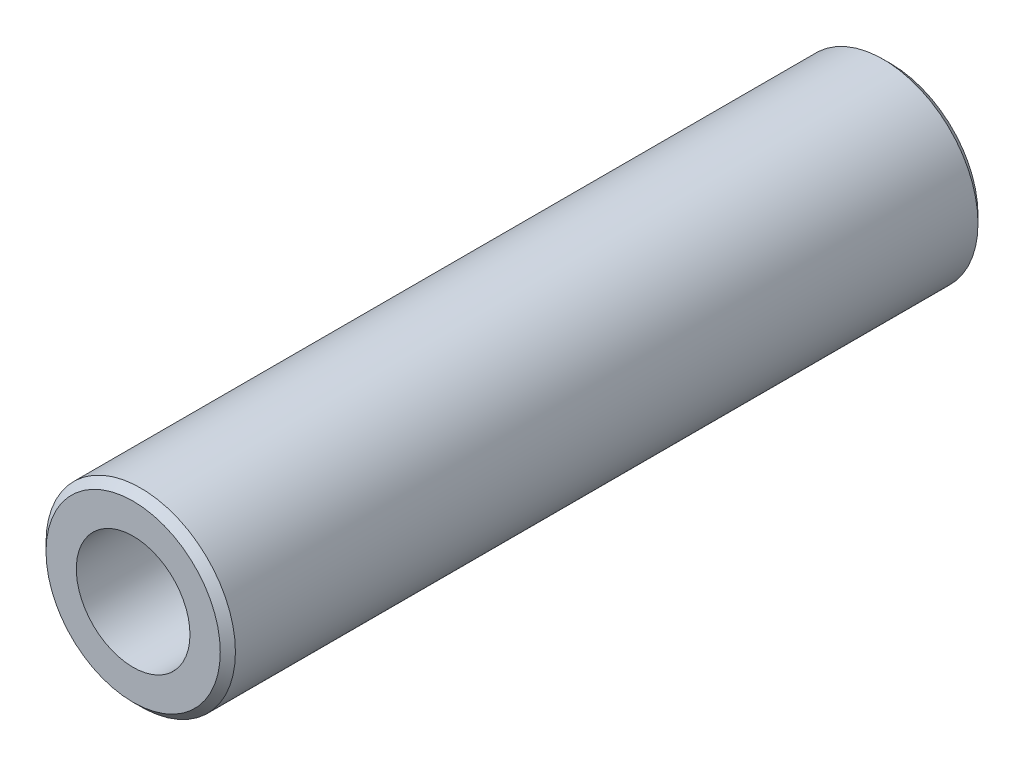
ISO-10303-21;
HEADER;
FILE_DESCRIPTION(('STEP AP214'),'2;1');
FILE_NAME('part.step','',(''),(''),'','','');
FILE_SCHEMA(('AUTOMOTIVE_DESIGN { 1 0 10303 214 1 1 1 1 }'));
ENDSEC;
DATA;
#1=APPLICATION_CONTEXT('core data for automotive mechanical design processes');
#2=APPLICATION_PROTOCOL_DEFINITION('international standard','automotive_design',2000,#1);
#3=PRODUCT_CONTEXT('',#1,'mechanical');
#4=PRODUCT('Part','Part','',(#3));
#5=PRODUCT_RELATED_PRODUCT_CATEGORY('part','',(#4));
#6=PRODUCT_DEFINITION_FORMATION('','',#4);
#7=PRODUCT_DEFINITION_CONTEXT('part definition',#1,'design');
#8=PRODUCT_DEFINITION('design','',#6,#7);
#9=PRODUCT_DEFINITION_SHAPE('','',#8);
#10=(LENGTH_UNIT() NAMED_UNIT(*) SI_UNIT(.MILLI.,.METRE.));
#11=(NAMED_UNIT(*) PLANE_ANGLE_UNIT() SI_UNIT($,.RADIAN.));
#12=(NAMED_UNIT(*) SI_UNIT($,.STERADIAN.) SOLID_ANGLE_UNIT());
#13=UNCERTAINTY_MEASURE_WITH_UNIT(LENGTH_MEASURE(1.E-05),#10,'distance_accuracy_value','');
#14=(GEOMETRIC_REPRESENTATION_CONTEXT(3) GLOBAL_UNCERTAINTY_ASSIGNED_CONTEXT((#13)) GLOBAL_UNIT_ASSIGNED_CONTEXT((#10,
#11,#12)) REPRESENTATION_CONTEXT('',''));
#15=CARTESIAN_POINT('',(0.,0.,0.));
#16=DIRECTION('',(0.,0.,1.));
#17=DIRECTION('',(1.,0.,0.));
#18=AXIS2_PLACEMENT_3D('',#15,#16,#17);
#19=CARTESIAN_POINT('',(0.,0.,25.));
#20=DIRECTION('',(0.,0.,1.));
#21=DIRECTION('',(1.,0.,0.));
#22=AXIS2_PLACEMENT_3D('',#19,#20,#21);
#23=PLANE('',#22);
#24=CARTESIAN_POINT('',(0.,0.,25.));
#25=DIRECTION('',(0.,0.,1.));
#26=DIRECTION('',(1.,0.,0.));
#27=AXIS2_PLACEMENT_3D('',#24,#25,#26);
#28=CIRCLE('',#27,5.75000000000002);
#29=CARTESIAN_POINT('',(5.75000000000002,0.,25.));
#30=VERTEX_POINT('',#29);
#31=EDGE_CURVE('E11',#30,#30,#28,.T.);
#32=ORIENTED_EDGE('',*,*,#31,.T.);
#33=EDGE_LOOP('',(#32));
#34=FACE_BOUND('',#33,.T.);
#35=CARTESIAN_POINT('',(0.,0.,25.));
#36=DIRECTION('',(0.,0.,1.));
#37=DIRECTION('',(1.,0.,0.));
#38=AXIS2_PLACEMENT_3D('',#35,#36,#37);
#39=CIRCLE('',#38,3.75000000000001);
#40=CARTESIAN_POINT('',(3.75000000000001,0.,25.));
#41=VERTEX_POINT('',#40);
#42=EDGE_CURVE('E59',#41,#41,#39,.T.);
#43=ORIENTED_EDGE('',*,*,#42,.F.);
#44=EDGE_LOOP('',(#43));
#45=FACE_BOUND('',#44,.T.);
#46=ADVANCED_FACE('F39',(#34,#45),#23,.T.);
#47=CARTESIAN_POINT('',(0.,0.,-25.));
#48=DIRECTION('',(0.,0.,1.));
#49=DIRECTION('',(1.,0.,0.));
#50=AXIS2_PLACEMENT_3D('',#47,#48,#49);
#51=PLANE('',#50);
#52=CARTESIAN_POINT('',(0.,0.,-25.));
#53=DIRECTION('',(0.,0.,1.));
#54=DIRECTION('',(1.,0.,0.));
#55=AXIS2_PLACEMENT_3D('',#52,#53,#54);
#56=CIRCLE('',#55,5.75);
#57=CARTESIAN_POINT('',(5.75,0.,-25.));
#58=VERTEX_POINT('',#57);
#59=EDGE_CURVE('E46',#58,#58,#56,.F.);
#60=ORIENTED_EDGE('',*,*,#59,.T.);
#61=EDGE_LOOP('',(#60));
#62=FACE_BOUND('',#61,.T.);
#63=CARTESIAN_POINT('',(0.,0.,-25.));
#64=DIRECTION('',(0.,0.,1.));
#65=DIRECTION('',(1.,0.,0.));
#66=AXIS2_PLACEMENT_3D('',#63,#64,#65);
#67=CIRCLE('',#66,3.75000000000001);
#68=CARTESIAN_POINT('',(3.75000000000001,0.,-25.));
#69=VERTEX_POINT('',#68);
#70=EDGE_CURVE('E60',#69,#69,#67,.T.);
#71=ORIENTED_EDGE('',*,*,#70,.T.);
#72=EDGE_LOOP('',(#71));
#73=FACE_BOUND('',#72,.T.);
#74=ADVANCED_FACE('F70',(#62,#73),#51,.F.);
#75=CARTESIAN_POINT('',(0.,0.,25.));
#76=DIRECTION('',(0.,0.,-1.));
#77=DIRECTION('',(-1.,0.,0.));
#78=AXIS2_PLACEMENT_3D('',#75,#76,#77);
#79=CYLINDRICAL_SURFACE('',#78,6.25000000000001);
#80=CARTESIAN_POINT('',(0.,0.,-24.5));
#81=DIRECTION('',(0.,0.,1.));
#82=DIRECTION('',(1.,0.,0.));
#83=AXIS2_PLACEMENT_3D('',#80,#81,#82);
#84=CIRCLE('',#83,6.25000000000001);
#85=CARTESIAN_POINT('',(6.25000000000001,0.,-24.5));
#86=VERTEX_POINT('',#85);
#87=EDGE_CURVE('E50',#86,#86,#84,.T.);
#88=ORIENTED_EDGE('',*,*,#87,.T.);
#89=EDGE_LOOP('',(#88));
#90=FACE_BOUND('',#89,.T.);
#91=CARTESIAN_POINT('',(0.,0.,24.5));
#92=DIRECTION('',(0.,0.,1.));
#93=DIRECTION('',(1.,0.,0.));
#94=AXIS2_PLACEMENT_3D('',#91,#92,#93);
#95=CIRCLE('',#94,6.25000000000001);
#96=CARTESIAN_POINT('',(6.25000000000001,0.,24.5));
#97=VERTEX_POINT('',#96);
#98=EDGE_CURVE('E54',#97,#97,#95,.F.);
#99=ORIENTED_EDGE('',*,*,#98,.T.);
#100=EDGE_LOOP('',(#99));
#101=FACE_BOUND('',#100,.T.);
#102=ADVANCED_FACE('F75',(#90,#101),#79,.T.);
#103=CARTESIAN_POINT('',(0.,0.,25.));
#104=DIRECTION('',(0.,0.,-1.));
#105=DIRECTION('',(-1.,0.,0.));
#106=AXIS2_PLACEMENT_3D('',#103,#104,#105);
#107=CYLINDRICAL_SURFACE('',#106,3.75000000000001);
#108=ORIENTED_EDGE('',*,*,#42,.T.);
#109=EDGE_LOOP('',(#108));
#110=FACE_BOUND('',#109,.T.);
#111=ORIENTED_EDGE('',*,*,#70,.F.);
#112=EDGE_LOOP('',(#111));
#113=FACE_BOUND('',#112,.T.);
#114=ADVANCED_FACE('F66',(#110,#113),#107,.F.);
#115=CARTESIAN_POINT('',(0.,0.,-24.5));
#116=DIRECTION('',(0.,0.,1.));
#117=DIRECTION('',(1.,0.,0.));
#118=AXIS2_PLACEMENT_3D('',#115,#116,#117);
#119=CONICAL_SURFACE('',#118,6.25000000000001,0.78539816339745);
#120=ORIENTED_EDGE('',*,*,#59,.F.);
#121=EDGE_LOOP('',(#120));
#122=FACE_BOUND('',#121,.T.);
#123=ORIENTED_EDGE('',*,*,#87,.F.);
#124=EDGE_LOOP('',(#123));
#125=FACE_BOUND('',#124,.T.);
#126=ADVANCED_FACE('F81',(#122,#125),#119,.T.);
#127=CARTESIAN_POINT('',(0.,0.,25.));
#128=DIRECTION('',(0.,0.,-1.));
#129=DIRECTION('',(-1.,0.,0.));
#130=AXIS2_PLACEMENT_3D('',#127,#128,#129);
#131=CONICAL_SURFACE('',#130,5.75000000000002,0.785398163397449);
#132=ORIENTED_EDGE('',*,*,#98,.F.);
#133=EDGE_LOOP('',(#132));
#134=FACE_BOUND('',#133,.T.);
#135=ORIENTED_EDGE('',*,*,#31,.F.);
#136=EDGE_LOOP('',(#135));
#137=FACE_BOUND('',#136,.T.);
#138=ADVANCED_FACE('F41',(#134,#137),#131,.T.);
#139=CLOSED_SHELL('',(#46,#74,#102,#114,#126,#138));
#140=MANIFOLD_SOLID_BREP('B2',#139);
#141=ADVANCED_BREP_SHAPE_REPRESENTATION('',(#18,#140),#14);
#142=SHAPE_DEFINITION_REPRESENTATION(#9,#141);
ENDSEC;
END-ISO-10303-21;
